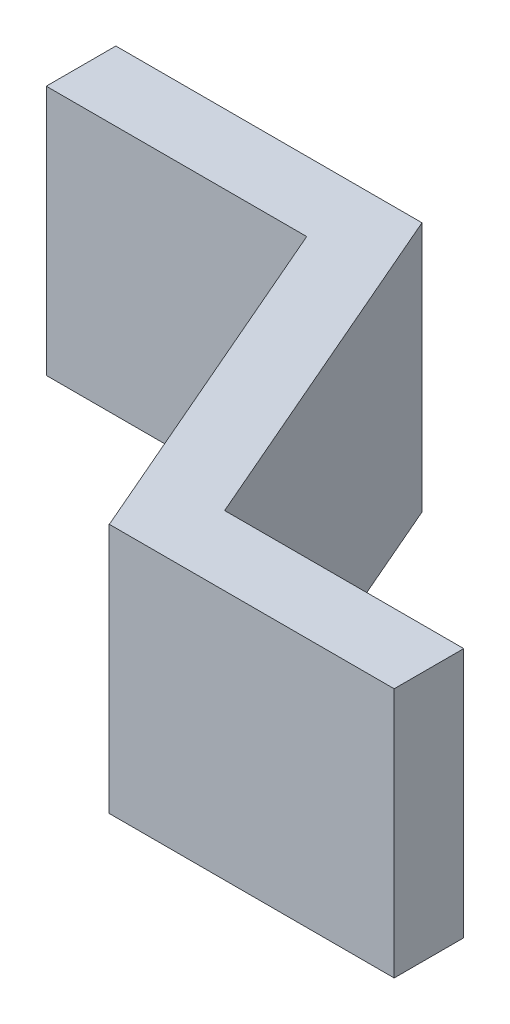
ISO-10303-21;
HEADER;
FILE_DESCRIPTION(('STEP AP214'),'2;1');
FILE_NAME('part.step','',(''),(''),'','','');
FILE_SCHEMA(('AUTOMOTIVE_DESIGN { 1 0 10303 214 1 1 1 1 }'));
ENDSEC;
DATA;
#1=APPLICATION_CONTEXT('core data for automotive mechanical design processes');
#2=APPLICATION_PROTOCOL_DEFINITION('international standard','automotive_design',2000,#1);
#3=PRODUCT_CONTEXT('',#1,'mechanical');
#4=PRODUCT('Part','Part','',(#3));
#5=PRODUCT_RELATED_PRODUCT_CATEGORY('part','',(#4));
#6=PRODUCT_DEFINITION_FORMATION('','',#4);
#7=PRODUCT_DEFINITION_CONTEXT('part definition',#1,'design');
#8=PRODUCT_DEFINITION('design','',#6,#7);
#9=PRODUCT_DEFINITION_SHAPE('','',#8);
#10=(LENGTH_UNIT() NAMED_UNIT(*) SI_UNIT(.MILLI.,.METRE.));
#11=(NAMED_UNIT(*) PLANE_ANGLE_UNIT() SI_UNIT($,.RADIAN.));
#12=(NAMED_UNIT(*) SI_UNIT($,.STERADIAN.) SOLID_ANGLE_UNIT());
#13=UNCERTAINTY_MEASURE_WITH_UNIT(LENGTH_MEASURE(1.E-05),#10,'distance_accuracy_value','');
#14=(GEOMETRIC_REPRESENTATION_CONTEXT(3) GLOBAL_UNCERTAINTY_ASSIGNED_CONTEXT((#13)) GLOBAL_UNIT_ASSIGNED_CONTEXT((#10,
#11,#12)) REPRESENTATION_CONTEXT('',''));
#15=CARTESIAN_POINT('',(0.,0.,0.));
#16=DIRECTION('',(0.,0.,1.));
#17=DIRECTION('',(1.,0.,0.));
#18=AXIS2_PLACEMENT_3D('',#15,#16,#17);
#19=CARTESIAN_POINT('',(0.,7.42,0.));
#20=DIRECTION('',(1.,0.,0.));
#21=DIRECTION('',(0.,0.,-1.));
#22=AXIS2_PLACEMENT_3D('',#19,#20,#21);
#23=PLANE('',#22);
#24=DIRECTION('',(0.,1.,0.));
#25=VECTOR('',#24,1.);
#26=CARTESIAN_POINT('',(0.,7.42,0.));
#27=LINE('',#26,#25);
#28=CARTESIAN_POINT('',(0.,7.780000014305,-1.30339419427667E-10));
#29=VERTEX_POINT('',#28);
#30=CARTESIAN_POINT('',(0.,7.42,-1.556831963824E-10));
#31=VERTEX_POINT('',#30);
#32=EDGE_CURVE('E123',#29,#31,#27,.F.);
#33=ORIENTED_EDGE('',*,*,#32,.T.);
#34=DIRECTION('',(0.,0.,1.));
#35=VECTOR('',#34,1.);
#36=CARTESIAN_POINT('',(0.,7.42,0.));
#37=LINE('',#36,#35);
#38=CARTESIAN_POINT('',(0.,7.42,0.10000000149));
#39=VERTEX_POINT('',#38);
#40=EDGE_CURVE('E115',#31,#39,#37,.T.);
#41=ORIENTED_EDGE('',*,*,#40,.T.);
#42=DIRECTION('',(0.,1.,0.));
#43=VECTOR('',#42,1.);
#44=CARTESIAN_POINT('',(0.,7.42,0.10000000149));
#45=LINE('',#44,#43);
#46=CARTESIAN_POINT('',(0.,7.780000014305,0.10000000149));
#47=VERTEX_POINT('',#46);
#48=EDGE_CURVE('E134',#47,#39,#45,.F.);
#49=ORIENTED_EDGE('',*,*,#48,.F.);
#50=DIRECTION('',(0.,0.,1.));
#51=VECTOR('',#50,1.);
#52=CARTESIAN_POINT('',(0.,7.780000014305,0.));
#53=LINE('',#52,#51);
#54=EDGE_CURVE('E140',#29,#47,#53,.T.);
#55=ORIENTED_EDGE('',*,*,#54,.F.);
#56=EDGE_LOOP('',(#33,#41,#49,#55));
#57=FACE_BOUND('',#56,.T.);
#58=ADVANCED_FACE('F17',(#57),#23,.F.);
#59=CARTESIAN_POINT('',(0.,7.42,0.10000000149));
#60=DIRECTION('',(0.,0.,1.));
#61=DIRECTION('',(1.,0.,0.));
#62=AXIS2_PLACEMENT_3D('',#59,#60,#61);
#63=PLANE('',#62);
#64=DIRECTION('',(0.,1.,0.));
#65=VECTOR('',#64,1.);
#66=CARTESIAN_POINT('',(0.374312226605181,7.42,0.100000001489922));
#67=LINE('',#66,#65);
#68=CARTESIAN_POINT('',(0.37431222660506,7.780000014305,0.100000001489974));
#69=VERTEX_POINT('',#68);
#70=CARTESIAN_POINT('',(0.374312226605091,7.42,0.100000001489974));
#71=VERTEX_POINT('',#70);
#72=EDGE_CURVE('E132',#69,#71,#67,.F.);
#73=ORIENTED_EDGE('',*,*,#72,.F.);
#74=DIRECTION('',(1.,0.,0.));
#75=VECTOR('',#74,1.);
#76=CARTESIAN_POINT('',(0.44,7.780000014305,0.10000000149));
#77=LINE('',#76,#75);
#78=EDGE_CURVE('E137',#47,#69,#77,.T.);
#79=ORIENTED_EDGE('',*,*,#78,.F.);
#80=ORIENTED_EDGE('',*,*,#48,.T.);
#81=DIRECTION('',(1.,0.,0.));
#82=VECTOR('',#81,1.);
#83=CARTESIAN_POINT('',(0.44,7.42,0.10000000149));
#84=LINE('',#83,#82);
#85=EDGE_CURVE('E111',#39,#71,#84,.T.);
#86=ORIENTED_EDGE('',*,*,#85,.T.);
#87=EDGE_LOOP('',(#73,#79,#80,#86));
#88=FACE_BOUND('',#87,.T.);
#89=ADVANCED_FACE('F214',(#88),#63,.T.);
#90=CARTESIAN_POINT('',(0.348224508223,7.42,0.03971472531736));
#91=DIRECTION('',(-0.917754904098641,0.,0.397147247255844));
#92=DIRECTION('',(0.397147247255844,0.,0.917754904098641));
#93=AXIS2_PLACEMENT_3D('',#90,#91,#92);
#94=PLANE('',#93);
#95=DIRECTION('',(0.397147247255413,0.,0.917754904098827));
#96=VECTOR('',#95,1.);
#97=CARTESIAN_POINT('',(0.374312226605,7.42,0.10000000149));
#98=LINE('',#97,#96);
#99=CARTESIAN_POINT('',(0.59,7.42,0.59842599627));
#100=VERTEX_POINT('',#99);
#101=EDGE_CURVE('E110',#71,#100,#98,.T.);
#102=ORIENTED_EDGE('',*,*,#101,.T.);
#103=DIRECTION('',(0.,1.,0.));
#104=VECTOR('',#103,1.);
#105=CARTESIAN_POINT('',(0.59,7.42,0.59842599627));
#106=LINE('',#105,#104);
#107=CARTESIAN_POINT('',(0.59,7.780000014305,0.59842599627));
#108=VERTEX_POINT('',#107);
#109=EDGE_CURVE('E86',#100,#108,#106,.T.);
#110=ORIENTED_EDGE('',*,*,#109,.T.);
#111=DIRECTION('',(0.397147247255413,0.,0.917754904098827));
#112=VECTOR('',#111,1.);
#113=CARTESIAN_POINT('',(0.374312226605,7.780000014305,0.10000000149));
#114=LINE('',#113,#112);
#115=EDGE_CURVE('E139',#69,#108,#114,.T.);
#116=ORIENTED_EDGE('',*,*,#115,.F.);
#117=ORIENTED_EDGE('',*,*,#72,.T.);
#118=EDGE_LOOP('',(#102,#110,#116,#117));
#119=FACE_BOUND('',#118,.T.);
#120=ADVANCED_FACE('F215',(#119),#94,.T.);
#121=CARTESIAN_POINT('',(0.59,7.42,0.5));
#122=DIRECTION('',(1.,0.,0.));
#123=DIRECTION('',(0.,0.,-1.));
#124=AXIS2_PLACEMENT_3D('',#121,#122,#123);
#125=PLANE('',#124);
#126=ORIENTED_EDGE('',*,*,#109,.F.);
#127=DIRECTION('',(0.,0.,-1.));
#128=VECTOR('',#127,1.);
#129=CARTESIAN_POINT('',(0.59,7.42,0.5));
#130=LINE('',#129,#128);
#131=CARTESIAN_POINT('',(0.59,7.42,0.60000000149));
#132=VERTEX_POINT('',#131);
#133=EDGE_CURVE('E20',#100,#132,#130,.F.);
#134=ORIENTED_EDGE('',*,*,#133,.T.);
#135=DIRECTION('',(0.,1.,0.));
#136=VECTOR('',#135,1.);
#137=CARTESIAN_POINT('',(0.59,7.42,0.60000000149));
#138=LINE('',#137,#136);
#139=CARTESIAN_POINT('',(0.59,7.780000014305,0.60000000149));
#140=VERTEX_POINT('',#139);
#141=EDGE_CURVE('E93',#140,#132,#138,.F.);
#142=ORIENTED_EDGE('',*,*,#141,.F.);
#143=DIRECTION('',(0.,0.,1.));
#144=VECTOR('',#143,1.);
#145=CARTESIAN_POINT('',(0.59,7.780000014305,0.));
#146=LINE('',#145,#144);
#147=EDGE_CURVE('E182',#108,#140,#146,.T.);
#148=ORIENTED_EDGE('',*,*,#147,.F.);
#149=EDGE_LOOP('',(#126,#134,#142,#148));
#150=FACE_BOUND('',#149,.T.);
#151=ADVANCED_FACE('F109',(#150),#125,.F.);
#152=CARTESIAN_POINT('',(0.59,7.42,0.60000000149));
#153=DIRECTION('',(0.,0.,1.));
#154=DIRECTION('',(1.,0.,0.));
#155=AXIS2_PLACEMENT_3D('',#152,#153,#154);
#156=PLANE('',#155);
#157=ORIENTED_EDGE('',*,*,#141,.T.);
#158=DIRECTION('',(1.,0.,0.));
#159=VECTOR('',#158,1.);
#160=CARTESIAN_POINT('',(0.44,7.42,0.60000000149));
#161=LINE('',#160,#159);
#162=CARTESIAN_POINT('',(0.999999996424,7.42,0.60000000149));
#163=VERTEX_POINT('',#162);
#164=EDGE_CURVE('E97',#132,#163,#161,.T.);
#165=ORIENTED_EDGE('',*,*,#164,.T.);
#166=DIRECTION('',(0.,1.,0.));
#167=VECTOR('',#166,1.);
#168=CARTESIAN_POINT('',(0.999999996424,7.42,0.60000000149));
#169=LINE('',#168,#167);
#170=CARTESIAN_POINT('',(0.999999996424,7.780000014305,0.60000000149));
#171=VERTEX_POINT('',#170);
#172=EDGE_CURVE('E99',#171,#163,#169,.F.);
#173=ORIENTED_EDGE('',*,*,#172,.F.);
#174=DIRECTION('',(1.,0.,0.));
#175=VECTOR('',#174,1.);
#176=CARTESIAN_POINT('',(0.44,7.780000014305,0.60000000149));
#177=LINE('',#176,#175);
#178=EDGE_CURVE('E98',#140,#171,#177,.T.);
#179=ORIENTED_EDGE('',*,*,#178,.F.);
#180=EDGE_LOOP('',(#157,#165,#173,#179));
#181=FACE_BOUND('',#180,.T.);
#182=ADVANCED_FACE('F95',(#181),#156,.T.);
#183=CARTESIAN_POINT('',(0.999999996424,7.42,0.5));
#184=DIRECTION('',(1.,0.,0.));
#185=DIRECTION('',(0.,0.,-1.));
#186=AXIS2_PLACEMENT_3D('',#183,#184,#185);
#187=PLANE('',#186);
#188=DIRECTION('',(0.,0.,1.));
#189=VECTOR('',#188,1.);
#190=CARTESIAN_POINT('',(0.999999996424,7.42,0.));
#191=LINE('',#190,#189);
#192=CARTESIAN_POINT('',(0.999999996424,7.42,0.5));
#193=VERTEX_POINT('',#192);
#194=EDGE_CURVE('E107',#163,#193,#191,.F.);
#195=ORIENTED_EDGE('',*,*,#194,.T.);
#196=DIRECTION('',(0.,1.,0.));
#197=VECTOR('',#196,1.);
#198=CARTESIAN_POINT('',(0.999999996424,7.42,0.5));
#199=LINE('',#198,#197);
#200=CARTESIAN_POINT('',(0.999999996424,7.780000014305,0.5));
#201=VERTEX_POINT('',#200);
#202=EDGE_CURVE('E192',#193,#201,#199,.T.);
#203=ORIENTED_EDGE('',*,*,#202,.T.);
#204=DIRECTION('',(0.,0.,1.));
#205=VECTOR('',#204,1.);
#206=CARTESIAN_POINT('',(0.999999996424,7.780000014305,0.));
#207=LINE('',#206,#205);
#208=EDGE_CURVE('E126',#171,#201,#207,.F.);
#209=ORIENTED_EDGE('',*,*,#208,.F.);
#210=ORIENTED_EDGE('',*,*,#172,.T.);
#211=EDGE_LOOP('',(#195,#203,#209,#210));
#212=FACE_BOUND('',#211,.T.);
#213=ADVANCED_FACE('F238',(#212),#187,.T.);
#214=CARTESIAN_POINT('',(0.,7.42,0.));
#215=DIRECTION('',(0.,0.,1.));
#216=DIRECTION('',(1.,0.,0.));
#217=AXIS2_PLACEMENT_3D('',#214,#215,#216);
#218=PLANE('',#217);
#219=DIRECTION('',(1.,0.,0.));
#220=VECTOR('',#219,1.);
#221=CARTESIAN_POINT('',(0.44,7.42,-2.335247945736E-10));
#222=LINE('',#221,#220);
#223=CARTESIAN_POINT('',(0.439999999656335,7.42,-3.43069646239979E-10));
#224=VERTEX_POINT('',#223);
#225=EDGE_CURVE('E155',#224,#31,#222,.F.);
#226=ORIENTED_EDGE('',*,*,#225,.T.);
#227=ORIENTED_EDGE('',*,*,#32,.F.);
#228=DIRECTION('',(1.,0.,0.));
#229=VECTOR('',#228,1.);
#230=CARTESIAN_POINT('',(0.44,7.780000014305,-1.955091291415E-10));
#231=LINE('',#230,#229);
#232=CARTESIAN_POINT('',(0.439999999458534,7.780000014305,-1.955091291415E-10));
#233=VERTEX_POINT('',#232);
#234=EDGE_CURVE('E147',#233,#29,#231,.F.);
#235=ORIENTED_EDGE('',*,*,#234,.F.);
#236=DIRECTION('',(0.,1.,0.));
#237=VECTOR('',#236,1.);
#238=CARTESIAN_POINT('',(0.439999999804137,7.42,-4.52614497906357E-10));
#239=LINE('',#238,#237);
#240=EDGE_CURVE('E128',#233,#224,#239,.F.);
#241=ORIENTED_EDGE('',*,*,#240,.T.);
#242=EDGE_LOOP('',(#226,#227,#235,#241));
#243=FACE_BOUND('',#242,.T.);
#244=ADVANCED_FACE('F235',(#243),#218,.F.);
#245=CARTESIAN_POINT('',(0.44,7.42,0.));
#246=DIRECTION('',(0.,1.,0.));
#247=DIRECTION('',(0.,0.,1.));
#248=AXIS2_PLACEMENT_3D('',#245,#246,#247);
#249=PLANE('',#248);
#250=DIRECTION('',(1.,0.,0.));
#251=VECTOR('',#250,1.);
#252=CARTESIAN_POINT('',(0.59,7.42,0.5));
#253=LINE('',#252,#251);
#254=CARTESIAN_POINT('',(0.656368904967001,7.42,0.499999999999999));
#255=VERTEX_POINT('',#254);
#256=EDGE_CURVE('E166',#255,#193,#253,.T.);
#257=ORIENTED_EDGE('',*,*,#256,.T.);
#258=ORIENTED_EDGE('',*,*,#194,.F.);
#259=ORIENTED_EDGE('',*,*,#164,.F.);
#260=ORIENTED_EDGE('',*,*,#133,.F.);
#261=ORIENTED_EDGE('',*,*,#101,.F.);
#262=ORIENTED_EDGE('',*,*,#85,.F.);
#263=ORIENTED_EDGE('',*,*,#40,.F.);
#264=ORIENTED_EDGE('',*,*,#225,.F.);
#265=DIRECTION('',(0.397147247255844,0.,0.917754904098641));
#266=VECTOR('',#265,1.);
#267=CARTESIAN_POINT('',(0.44,7.42,0.));
#268=LINE('',#267,#266);
#269=EDGE_CURVE('E160',#224,#255,#268,.T.);
#270=ORIENTED_EDGE('',*,*,#269,.T.);
#271=EDGE_LOOP('',(#257,#258,#259,#260,#261,#262,#263,#264,#270));
#272=FACE_BOUND('',#271,.T.);
#273=ADVANCED_FACE('F104',(#272),#249,.F.);
#274=CARTESIAN_POINT('',(0.59,7.42,0.5));
#275=DIRECTION('',(0.,0.,1.));
#276=DIRECTION('',(1.,0.,0.));
#277=AXIS2_PLACEMENT_3D('',#274,#275,#276);
#278=PLANE('',#277);
#279=ORIENTED_EDGE('',*,*,#256,.F.);
#280=DIRECTION('',(0.,1.,0.));
#281=VECTOR('',#280,1.);
#282=CARTESIAN_POINT('',(0.656368904967005,7.42,0.499999999999998));
#283=LINE('',#282,#281);
#284=CARTESIAN_POINT('',(0.656368904967001,7.780000014305,0.499999999999999));
#285=VERTEX_POINT('',#284);
#286=EDGE_CURVE('E26',#255,#285,#283,.T.);
#287=ORIENTED_EDGE('',*,*,#286,.T.);
#288=DIRECTION('',(1.,0.,0.));
#289=VECTOR('',#288,1.);
#290=CARTESIAN_POINT('',(0.44,7.780000014305,0.5));
#291=LINE('',#290,#289);
#292=EDGE_CURVE('E34',#201,#285,#291,.F.);
#293=ORIENTED_EDGE('',*,*,#292,.F.);
#294=ORIENTED_EDGE('',*,*,#202,.F.);
#295=EDGE_LOOP('',(#279,#287,#293,#294));
#296=FACE_BOUND('',#295,.T.);
#297=ADVANCED_FACE('F199',(#296),#278,.F.);
#298=CARTESIAN_POINT('',(0.44,7.780000014305,0.));
#299=DIRECTION('',(0.,1.,0.));
#300=DIRECTION('',(0.,0.,1.));
#301=AXIS2_PLACEMENT_3D('',#298,#299,#300);
#302=PLANE('',#301);
#303=ORIENTED_EDGE('',*,*,#178,.T.);
#304=ORIENTED_EDGE('',*,*,#208,.T.);
#305=ORIENTED_EDGE('',*,*,#292,.T.);
#306=DIRECTION('',(0.397147247255844,0.,0.917754904098641));
#307=VECTOR('',#306,1.);
#308=CARTESIAN_POINT('',(0.44,7.780000014305,0.));
#309=LINE('',#308,#307);
#310=EDGE_CURVE('E11',#285,#233,#309,.F.);
#311=ORIENTED_EDGE('',*,*,#310,.T.);
#312=ORIENTED_EDGE('',*,*,#234,.T.);
#313=ORIENTED_EDGE('',*,*,#54,.T.);
#314=ORIENTED_EDGE('',*,*,#78,.T.);
#315=ORIENTED_EDGE('',*,*,#115,.T.);
#316=ORIENTED_EDGE('',*,*,#147,.T.);
#317=EDGE_LOOP('',(#303,#304,#305,#311,#312,#313,#314,#315,#316));
#318=FACE_BOUND('',#317,.T.);
#319=ADVANCED_FACE('F204',(#318),#302,.T.);
#320=CARTESIAN_POINT('',(0.44,7.42,0.));
#321=DIRECTION('',(-0.917754904098641,0.,0.397147247255844));
#322=DIRECTION('',(0.397147247255844,0.,0.917754904098641));
#323=AXIS2_PLACEMENT_3D('',#320,#321,#322);
#324=PLANE('',#323);
#325=ORIENTED_EDGE('',*,*,#286,.F.);
#326=ORIENTED_EDGE('',*,*,#269,.F.);
#327=ORIENTED_EDGE('',*,*,#240,.F.);
#328=ORIENTED_EDGE('',*,*,#310,.F.);
#329=EDGE_LOOP('',(#325,#326,#327,#328));
#330=FACE_BOUND('',#329,.T.);
#331=ADVANCED_FACE('F201',(#330),#324,.F.);
#332=CLOSED_SHELL('',(#58,#89,#120,#151,#182,#213,#244,#273,#297,#319,#331));
#333=MANIFOLD_SOLID_BREP('B1',#332);
#334=ADVANCED_BREP_SHAPE_REPRESENTATION('',(#18,#333),#14);
#335=SHAPE_DEFINITION_REPRESENTATION(#9,#334);
ENDSEC;
END-ISO-10303-21;
